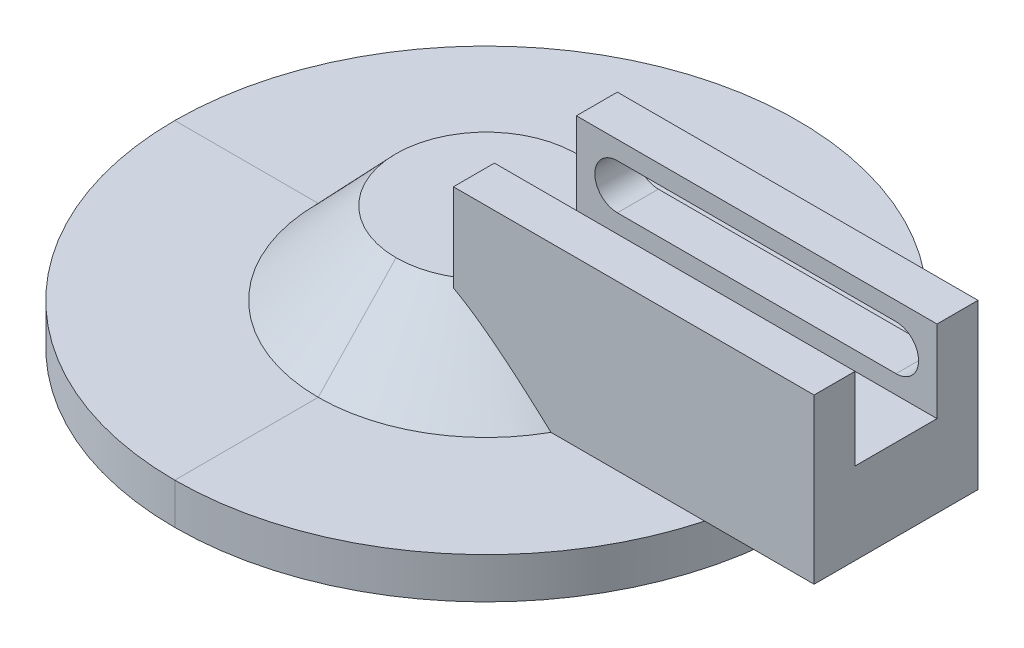
ISO-10303-21;
HEADER;
FILE_DESCRIPTION(('STEP AP214'),'2;1');
FILE_NAME('part.step','',(''),(''),'','','');
FILE_SCHEMA(('AUTOMOTIVE_DESIGN { 1 0 10303 214 1 1 1 1 }'));
ENDSEC;
DATA;
#1=APPLICATION_CONTEXT('core data for automotive mechanical design processes');
#2=APPLICATION_PROTOCOL_DEFINITION('international standard','automotive_design',2000,#1);
#3=PRODUCT_CONTEXT('',#1,'mechanical');
#4=PRODUCT('Part','Part','',(#3));
#5=PRODUCT_RELATED_PRODUCT_CATEGORY('part','',(#4));
#6=PRODUCT_DEFINITION_FORMATION('','',#4);
#7=PRODUCT_DEFINITION_CONTEXT('part definition',#1,'design');
#8=PRODUCT_DEFINITION('design','',#6,#7);
#9=PRODUCT_DEFINITION_SHAPE('','',#8);
#10=(LENGTH_UNIT() NAMED_UNIT(*) SI_UNIT(.MILLI.,.METRE.));
#11=(NAMED_UNIT(*) PLANE_ANGLE_UNIT() SI_UNIT($,.RADIAN.));
#12=(NAMED_UNIT(*) SI_UNIT($,.STERADIAN.) SOLID_ANGLE_UNIT());
#13=UNCERTAINTY_MEASURE_WITH_UNIT(LENGTH_MEASURE(1.E-05),#10,'distance_accuracy_value','');
#14=(GEOMETRIC_REPRESENTATION_CONTEXT(3) GLOBAL_UNCERTAINTY_ASSIGNED_CONTEXT((#13)) GLOBAL_UNIT_ASSIGNED_CONTEXT((#10,
#11,#12)) REPRESENTATION_CONTEXT('',''));
#15=CARTESIAN_POINT('',(0.,0.,0.));
#16=DIRECTION('',(0.,0.,1.));
#17=DIRECTION('',(1.,0.,0.));
#18=AXIS2_PLACEMENT_3D('',#15,#16,#17);
#19=CARTESIAN_POINT('',(0.,0.,0.));
#20=DIRECTION('',(0.,1.,0.));
#21=DIRECTION('',(0.,0.,1.));
#22=AXIS2_PLACEMENT_3D('',#19,#20,#21);
#23=PLANE('',#22);
#24=CARTESIAN_POINT('',(-6.,0.,-10.));
#25=DIRECTION('',(0.,-1.,0.));
#26=DIRECTION('',(-1.,0.,0.));
#27=AXIS2_PLACEMENT_3D('',#24,#25,#26);
#28=CIRCLE('',#27,11.);
#29=CARTESIAN_POINT('',(-17.,0.,-10.));
#30=VERTEX_POINT('',#29);
#31=CARTESIAN_POINT('',(-6.,0.,0.999999999999999));
#32=VERTEX_POINT('',#31);
#33=EDGE_CURVE('E54',#30,#32,#28,.T.);
#34=ORIENTED_EDGE('',*,*,#33,.T.);
#35=CARTESIAN_POINT('',(-6.,0.,-10.));
#36=DIRECTION('',(0.,-1.,0.));
#37=DIRECTION('',(0.,0.,1.));
#38=AXIS2_PLACEMENT_3D('',#35,#36,#37);
#39=CIRCLE('',#38,11.);
#40=EDGE_CURVE('E222',#32,#30,#39,.T.);
#41=ORIENTED_EDGE('',*,*,#40,.T.);
#42=EDGE_LOOP('',(#34,#41));
#43=FACE_BOUND('',#42,.T.);
#44=CARTESIAN_POINT('',(-6.,0.,-10.));
#45=DIRECTION('',(0.,1.,0.));
#46=DIRECTION('',(0.,0.,1.));
#47=AXIS2_PLACEMENT_3D('',#44,#45,#46);
#48=CIRCLE('',#47,2.55);
#49=CARTESIAN_POINT('',(-6.,0.,-7.45));
#50=VERTEX_POINT('',#49);
#51=EDGE_CURVE('E48',#50,#50,#48,.T.);
#52=ORIENTED_EDGE('',*,*,#51,.T.);
#53=EDGE_LOOP('',(#52));
#54=FACE_BOUND('',#53,.T.);
#55=ADVANCED_FACE('F43',(#43,#54),#23,.F.);
#56=CARTESIAN_POINT('',(-6.,7.5,-10.));
#57=DIRECTION('',(0.,-1.,0.));
#58=DIRECTION('',(0.,0.,-1.));
#59=AXIS2_PLACEMENT_3D('',#56,#57,#58);
#60=CYLINDRICAL_SURFACE('',#59,2.55);
#61=ORIENTED_EDGE('',*,*,#51,.F.);
#62=EDGE_LOOP('',(#61));
#63=FACE_BOUND('',#62,.T.);
#64=CARTESIAN_POINT('',(-6.,7.5,-10.));
#65=DIRECTION('',(0.,1.,0.));
#66=DIRECTION('',(0.,0.,1.));
#67=AXIS2_PLACEMENT_3D('',#64,#65,#66);
#68=CIRCLE('',#67,2.55);
#69=CARTESIAN_POINT('',(-6.,7.5,-7.45));
#70=VERTEX_POINT('',#69);
#71=EDGE_CURVE('E446',#70,#70,#68,.T.);
#72=ORIENTED_EDGE('',*,*,#71,.T.);
#73=EDGE_LOOP('',(#72));
#74=FACE_BOUND('',#73,.T.);
#75=ADVANCED_FACE('F513',(#63,#74),#60,.F.);
#76=CARTESIAN_POINT('',(0.,7.5,0.));
#77=DIRECTION('',(0.,1.,0.));
#78=DIRECTION('',(0.,0.,1.));
#79=AXIS2_PLACEMENT_3D('',#76,#77,#78);
#80=PLANE('',#79);
#81=ORIENTED_EDGE('',*,*,#71,.F.);
#82=EDGE_LOOP('',(#81));
#83=FACE_BOUND('',#82,.T.);
#84=ADVANCED_FACE('F519',(#83),#80,.F.);
#85=CARTESIAN_POINT('',(-26.5,0.,-10.));
#86=DIRECTION('',(0.,1.,0.));
#87=DIRECTION('',(0.,0.,1.));
#88=AXIS2_PLACEMENT_3D('',#85,#86,#87);
#89=PLANE('',#88);
#90=DIRECTION('',(1.,0.,0.));
#91=VECTOR('',#90,1.);
#92=CARTESIAN_POINT('',(0.,0.,0.));
#93=LINE('',#92,#91);
#94=CARTESIAN_POINT('',(11.8955301681733,0.,0.));
#95=VERTEX_POINT('',#94);
#96=CARTESIAN_POINT('',(30.6606055596467,0.,0.));
#97=VERTEX_POINT('',#96);
#98=EDGE_CURVE('E453',#95,#97,#93,.T.);
#99=ORIENTED_EDGE('',*,*,#98,.F.);
#100=CARTESIAN_POINT('',(-6.,0.,-10.));
#101=DIRECTION('',(0.,-1.,0.));
#102=DIRECTION('',(-1.,0.,0.));
#103=AXIS2_PLACEMENT_3D('',#100,#101,#102);
#104=CIRCLE('',#103,20.5);
#105=CARTESIAN_POINT('',(-5.99999999999999,0.,10.5));
#106=VERTEX_POINT('',#105);
#107=EDGE_CURVE('E270',#95,#106,#104,.T.);
#108=ORIENTED_EDGE('',*,*,#107,.T.);
#109=DIRECTION('',(0.,0.,-1.));
#110=VECTOR('',#109,1.);
#111=CARTESIAN_POINT('',(-6.,0.,10.5));
#112=LINE('',#111,#110);
#113=CARTESIAN_POINT('',(-5.99999999999999,0.,28.));
#114=VERTEX_POINT('',#113);
#115=EDGE_CURVE('E266',#114,#106,#112,.T.);
#116=ORIENTED_EDGE('',*,*,#115,.F.);
#117=CARTESIAN_POINT('',(-6.,0.,-10.));
#118=DIRECTION('',(0.,-1.,0.));
#119=DIRECTION('',(-1.,0.,0.));
#120=AXIS2_PLACEMENT_3D('',#117,#118,#119);
#121=CIRCLE('',#120,38.);
#122=EDGE_CURVE('E57',#97,#114,#121,.T.);
#123=ORIENTED_EDGE('',*,*,#122,.F.);
#124=EDGE_LOOP('',(#99,#108,#116,#123));
#125=FACE_BOUND('',#124,.T.);
#126=ADVANCED_FACE('F569',(#125),#89,.T.);
#127=CARTESIAN_POINT('',(-6.,0.,-10.));
#128=DIRECTION('',(0.,-1.,0.));
#129=DIRECTION('',(0.,0.,-1.));
#130=AXIS2_PLACEMENT_3D('',#127,#128,#129);
#131=CONICAL_SURFACE('',#130,20.5,0.759762754875771);
#132=CARTESIAN_POINT('',(0.,15.2631578517544,-10.0007));
#133=CARTESIAN_POINT('',(0.,15.2631708937644,-9.92486295488119));
#134=CARTESIAN_POINT('',(0.,15.2616624077463,-9.84903402731627));
#135=CARTESIAN_POINT('',(0.,15.2556377750741,-9.69750242471605));
#136=CARTESIAN_POINT('',(0.,15.2511219010244,-9.62179973886106));
#137=CARTESIAN_POINT('',(0.,15.2331331536125,-9.39524314324602));
#138=CARTESIAN_POINT('',(0.,15.2152189771487,-9.24472168165171));
#139=CARTESIAN_POINT('',(0.,15.168627023094,-8.94789489611168));
#140=CARTESIAN_POINT('',(0.,15.1401288071867,-8.80156080240538));
#141=CARTESIAN_POINT('',(0.,15.073321295965,-8.51112105104973));
#142=CARTESIAN_POINT('',(0.,15.035008501025,-8.36701620776956));
#143=CARTESIAN_POINT('',(0.,14.9148242663668,-7.96470673103297));
#144=CARTESIAN_POINT('',(0.,14.8229398833535,-7.70947797849739));
#145=CARTESIAN_POINT('',(0.,14.6171267733771,-7.20806455911059));
#146=CARTESIAN_POINT('',(0.,14.5031778808774,-6.96188841254049));
#147=CARTESIAN_POINT('',(0.,14.256573268325,-6.47349690640743));
#148=CARTESIAN_POINT('',(0.,14.1236121352738,-6.23143757873596));
#149=CARTESIAN_POINT('',(0.,13.8450417046871,-5.75491669936017));
#150=CARTESIAN_POINT('',(0.,13.6994370446049,-5.52045240487632));
#151=CARTESIAN_POINT('',(0.,13.3904074275809,-5.04505925818382));
#152=CARTESIAN_POINT('',(0.,13.2264428593904,-4.80448356497862));
#153=CARTESIAN_POINT('',(0.,12.8904741071394,-4.32898900687896));
#154=CARTESIAN_POINT('',(0.,12.71846857033,-4.09407110395168));
#155=CARTESIAN_POINT('',(0.,12.3681171760259,-3.62865646778906));
#156=CARTESIAN_POINT('',(0.,12.189765045737,-3.39816447597561));
#157=CARTESIAN_POINT('',(0.,11.8282218498624,-2.94100446813114));
#158=CARTESIAN_POINT('',(0.,11.6450305880864,-2.71433660775229));
#159=CARTESIAN_POINT('',(0.,11.2852803897885,-2.27691317133302));
#160=CARTESIAN_POINT('',(0.,11.1089330086854,-2.06598315994636));
#161=CARTESIAN_POINT('',(0.,10.7534323044949,-1.64649508178609));
#162=CARTESIAN_POINT('',(0.,10.5742789081329,-1.43793707720001));
#163=CARTESIAN_POINT('',(0.,10.2141334876021,-1.02338137324999));
#164=CARTESIAN_POINT('',(0.,10.0331475517093,-0.817378375762518));
#165=CARTESIAN_POINT('',(0.,9.66924727858725,-0.407110193079388));
#166=CARTESIAN_POINT('',(0.,9.48633309140965,-0.202844874864835));
#167=CARTESIAN_POINT('',(0.,9.30262732600062,0.000700000000000541));
#168=B_SPLINE_CURVE_WITH_KNOTS('',3,(#132,#133,#134,#135,#136,#137,#138,#139,#140,#141,#142,
#143,#144,#145,#146,#147,#148,#149,#150,#151,#152,#153,#154,#155,#156,#157,#158,#159,#160,#161,
#162,#163,#164,#165,#166,#167),.UNSPECIFIED.,.F.,.F.,(4,2,2,2,2,2,2,2,2,2,2,2,2,2,2,2,2,4),(0.,
0.227479877731248,0.454939138392,0.909202487800251,1.35608715263062,1.80313138734546,
2.6154365871104,3.42848771557544,4.25648699272817,5.08418384488504,5.95738068323528,
6.83072495369531,7.70495779307996,8.57922613059734,9.4040058705165,10.2288071842845,
11.0514352682714,11.8739998031617),.UNSPECIFIED.);
#169=CARTESIAN_POINT('',(0.,10.,-0.780455542707111));
#170=VERTEX_POINT('',#169);
#171=CARTESIAN_POINT('',(0.,9.30325916874674,0.));
#172=VERTEX_POINT('',#171);
#173=EDGE_CURVE('E345',#170,#172,#168,.T.);
#174=ORIENTED_EDGE('',*,*,#173,.F.);
#175=CARTESIAN_POINT('',(-6.,10.,-10.));
#176=DIRECTION('',(0.,-1.,0.));
#177=DIRECTION('',(-1.,0.,0.));
#178=AXIS2_PLACEMENT_3D('',#175,#176,#177);
#179=CIRCLE('',#178,11.);
#180=CARTESIAN_POINT('',(-6.,10.,0.999999999999999));
#181=VERTEX_POINT('',#180);
#182=EDGE_CURVE('E286',#170,#181,#179,.T.);
#183=ORIENTED_EDGE('',*,*,#182,.T.);
#184=DIRECTION('',(0.,0.724999433594414,-0.688749461914693));
#185=VECTOR('',#184,1.);
#186=CARTESIAN_POINT('',(-6.,10.,0.999999999999997));
#187=LINE('',#186,#185);
#188=EDGE_CURVE('E281',#106,#181,#187,.T.);
#189=ORIENTED_EDGE('',*,*,#188,.F.);
#190=ORIENTED_EDGE('',*,*,#107,.F.);
#191=CARTESIAN_POINT('',(-6.0007,11.0526315531579,0.));
#192=CARTESIAN_POINT('',(-5.87428990100135,11.0526470835422,0.));
#193=CARTESIAN_POINT('',(-5.74789347357525,11.0501261311713,0.));
#194=CARTESIAN_POINT('',(-5.49531136074231,11.0400703412784,0.));
#195=CARTESIAN_POINT('',(-5.36912565726386,11.0325359584597,0.));
#196=CARTESIAN_POINT('',(-4.99149011710038,11.0025295649885,0.));
#197=CARTESIAN_POINT('',(-4.74059485999688,10.9726539927723,0.));
#198=CARTESIAN_POINT('',(-4.24589052292776,10.8949699638763,0.));
#199=CARTESIAN_POINT('',(-4.00203279333361,10.8474649921303,0.));
#200=CARTESIAN_POINT('',(-3.51802910101837,10.7361081510763,0.));
#201=CARTESIAN_POINT('',(-3.27788451179349,10.6722503793089,0.));
#202=CARTESIAN_POINT('',(-2.60756353563897,10.47197350406,0.));
#203=CARTESIAN_POINT('',(-2.18234622399832,10.3188837780749,0.));
#204=CARTESIAN_POINT('',(-1.34694579797003,9.97598651775762,0.));
#205=CARTESIAN_POINT('',(-0.936776739894965,9.78614564381578,0.));
#206=CARTESIAN_POINT('',(-0.328195004622588,9.47885621297837,0.));
#207=CARTESIAN_POINT('',(-0.124556977982722,9.37154828823432,0.));
#208=CARTESIAN_POINT('',(0.279345023470627,9.15074460821882,0.));
#209=CARTESIAN_POINT('',(0.47960896149272,9.03724878553101,0.));
#210=CARTESIAN_POINT('',(0.876922827378911,8.80497812331635,0.));
#211=CARTESIAN_POINT('',(1.07397410682978,8.68620558640485,0.));
#212=CARTESIAN_POINT('',(1.46521431518069,8.44404563217753,0.));
#213=CARTESIAN_POINT('',(1.65940324397193,8.32065821468628,0.));
#214=CARTESIAN_POINT('',(2.0866640541892,8.04290211124555,0.));
#215=CARTESIAN_POINT('',(2.31911456288505,7.88757842314489,0.));
#216=CARTESIAN_POINT('',(2.78058453242819,7.57190672396082,0.));
#217=CARTESIAN_POINT('',(3.00960381302985,7.41155845028958,0.));
#218=CARTESIAN_POINT('',(3.69216827018812,6.92406138735136,0.));
#219=CARTESIAN_POINT('',(4.14114441417035,6.59051021275516,0.));
#220=CARTESIAN_POINT('',(5.03001741156925,5.91034873687691,0.));
#221=CARTESIAN_POINT('',(5.46990059293891,5.56372071155819,0.));
#222=CARTESIAN_POINT('',(6.34185728384099,4.86088917583055,0.));
#223=CARTESIAN_POINT('',(6.77393156099044,4.50468661525696,0.));
#224=CARTESIAN_POINT('',(7.60331909012637,3.80873302122002,0.));
#225=CARTESIAN_POINT('',(8.00103517604962,3.46946049826856,0.));
#226=CARTESIAN_POINT('',(8.79195830031774,2.78568004815452,0.));
#227=CARTESIAN_POINT('',(9.18516518477147,2.44117194323815,0.));
#228=CARTESIAN_POINT('',(9.96650356899167,1.74906852792403,0.));
#229=CARTESIAN_POINT('',(10.3546476389916,1.40148738279058,0.));
#230=CARTESIAN_POINT('',(11.1277263396571,0.702839657505729,0.));
#231=CARTESIAN_POINT('',(11.512661248033,0.351773384828647,0.));
#232=CARTESIAN_POINT('',(11.8962919467197,-0.000699999999995392,0.));
#233=B_SPLINE_CURVE_WITH_KNOTS('',3,(#191,#192,#193,#194,#195,#196,#197,#198,#199,#200,#201,
#202,#203,#204,#205,#206,#207,#208,#209,#210,#211,#212,#213,#214,#215,#216,#217,#218,#219,#220,
#221,#222,#223,#224,#225,#226,#227,#228,#229,#230,#231,#232),.UNSPECIFIED.,.F.,.F.,(4,2,2,2,2,2,
2,2,2,2,2,2,2,2,2,2,2,2,2,2,4),(0.,0.379178155385036,0.758321925126976,1.51551162529428,
2.2602293603117,3.00521627719552,4.35856721051394,5.71315166820957,6.40360764422959,
7.09407114418192,7.78423624845764,8.47440137896786,9.31302660095649,10.1516957233361,
11.8293055740761,13.5092772281205,15.1890828323667,16.7573270752707,18.3256246812712,
19.8886810294079,21.4516006816987),.UNSPECIFIED.);
#234=EDGE_CURVE('E338',#172,#95,#233,.T.);
#235=ORIENTED_EDGE('',*,*,#234,.F.);
#236=EDGE_LOOP('',(#174,#183,#189,#190,#235));
#237=FACE_BOUND('',#236,.T.);
#238=ADVANCED_FACE('F329',(#237),#131,.T.);
#239=CARTESIAN_POINT('',(-6.,0.,-10.));
#240=DIRECTION('',(0.,-1.,0.));
#241=DIRECTION('',(0.,0.,-1.));
#242=AXIS2_PLACEMENT_3D('',#239,#240,#241);
#243=CONICAL_SURFACE('',#242,20.5,0.759762754875771);
#244=CARTESIAN_POINT('',(-6.,0.,-10.));
#245=DIRECTION('',(0.,-1.,0.));
#246=DIRECTION('',(0.,0.,1.));
#247=AXIS2_PLACEMENT_3D('',#244,#245,#246);
#248=CIRCLE('',#247,20.5);
#249=CARTESIAN_POINT('',(-26.5,0.,-10.));
#250=VERTEX_POINT('',#249);
#251=EDGE_CURVE('E273',#106,#250,#248,.T.);
#252=ORIENTED_EDGE('',*,*,#251,.F.);
#253=ORIENTED_EDGE('',*,*,#188,.T.);
#254=CARTESIAN_POINT('',(-6.,10.,-10.));
#255=DIRECTION('',(0.,-1.,0.));
#256=DIRECTION('',(0.,0.,1.));
#257=AXIS2_PLACEMENT_3D('',#254,#255,#256);
#258=CIRCLE('',#257,11.);
#259=CARTESIAN_POINT('',(-17.,10.,-10.));
#260=VERTEX_POINT('',#259);
#261=EDGE_CURVE('E289',#181,#260,#258,.T.);
#262=ORIENTED_EDGE('',*,*,#261,.T.);
#263=DIRECTION('',(0.688749461914693,0.724999433594414,0.));
#264=VECTOR('',#263,1.);
#265=CARTESIAN_POINT('',(-17.,10.,-10.));
#266=LINE('',#265,#264);
#267=EDGE_CURVE('E277',#250,#260,#266,.T.);
#268=ORIENTED_EDGE('',*,*,#267,.F.);
#269=EDGE_LOOP('',(#252,#253,#262,#268));
#270=FACE_BOUND('',#269,.T.);
#271=ADVANCED_FACE('F332',(#270),#243,.T.);
#272=CARTESIAN_POINT('',(-6.,0.,10.5));
#273=DIRECTION('',(0.,1.,0.));
#274=DIRECTION('',(0.,0.,1.));
#275=AXIS2_PLACEMENT_3D('',#272,#273,#274);
#276=PLANE('',#275);
#277=CARTESIAN_POINT('',(-6.,0.,-10.));
#278=DIRECTION('',(0.,-1.,0.));
#279=DIRECTION('',(0.,0.,1.));
#280=AXIS2_PLACEMENT_3D('',#277,#278,#279);
#281=CIRCLE('',#280,38.);
#282=CARTESIAN_POINT('',(-44.,0.,-10.));
#283=VERTEX_POINT('',#282);
#284=EDGE_CURVE('E259',#114,#283,#281,.T.);
#285=ORIENTED_EDGE('',*,*,#284,.F.);
#286=ORIENTED_EDGE('',*,*,#115,.T.);
#287=ORIENTED_EDGE('',*,*,#251,.T.);
#288=DIRECTION('',(1.,0.,0.));
#289=VECTOR('',#288,1.);
#290=CARTESIAN_POINT('',(-26.5,0.,-10.));
#291=LINE('',#290,#289);
#292=EDGE_CURVE('E263',#283,#250,#291,.T.);
#293=ORIENTED_EDGE('',*,*,#292,.F.);
#294=EDGE_LOOP('',(#285,#286,#287,#293));
#295=FACE_BOUND('',#294,.T.);
#296=ADVANCED_FACE('F330',(#295),#276,.T.);
#297=CARTESIAN_POINT('',(-6.,0.,-10.));
#298=DIRECTION('',(0.,-1.,0.));
#299=DIRECTION('',(0.,0.,-1.));
#300=AXIS2_PLACEMENT_3D('',#297,#298,#299);
#301=CYLINDRICAL_SURFACE('',#300,38.);
#302=CARTESIAN_POINT('',(-6.,-5.,-10.));
#303=DIRECTION('',(0.,-1.,0.));
#304=DIRECTION('',(0.,0.,1.));
#305=AXIS2_PLACEMENT_3D('',#302,#303,#304);
#306=CIRCLE('',#305,38.);
#307=CARTESIAN_POINT('',(-5.99999999999999,-5.,28.));
#308=VERTEX_POINT('',#307);
#309=CARTESIAN_POINT('',(-44.,-5.,-10.));
#310=VERTEX_POINT('',#309);
#311=EDGE_CURVE('E249',#308,#310,#306,.T.);
#312=ORIENTED_EDGE('',*,*,#311,.F.);
#313=DIRECTION('',(0.,1.,0.));
#314=VECTOR('',#313,1.);
#315=CARTESIAN_POINT('',(-6.,0.,28.));
#316=LINE('',#315,#314);
#317=EDGE_CURVE('E254',#308,#114,#316,.T.);
#318=ORIENTED_EDGE('',*,*,#317,.T.);
#319=ORIENTED_EDGE('',*,*,#284,.T.);
#320=DIRECTION('',(0.,1.,0.));
#321=VECTOR('',#320,1.);
#322=CARTESIAN_POINT('',(-44.,0.,-10.));
#323=LINE('',#322,#321);
#324=EDGE_CURVE('E237',#310,#283,#323,.T.);
#325=ORIENTED_EDGE('',*,*,#324,.F.);
#326=EDGE_LOOP('',(#312,#318,#319,#325));
#327=FACE_BOUND('',#326,.T.);
#328=ADVANCED_FACE('F571',(#327),#301,.T.);
#329=CARTESIAN_POINT('',(-5.99999999999999,-5.,28.));
#330=DIRECTION('',(0.,-1.,0.));
#331=DIRECTION('',(0.,0.,-1.));
#332=AXIS2_PLACEMENT_3D('',#329,#330,#331);
#333=PLANE('',#332);
#334=CARTESIAN_POINT('',(-6.,-5.,-10.));
#335=DIRECTION('',(0.,-1.,0.));
#336=DIRECTION('',(0.,0.,1.));
#337=AXIS2_PLACEMENT_3D('',#334,#335,#336);
#338=CIRCLE('',#337,20.5);
#339=CARTESIAN_POINT('',(-5.99999999999999,-5.,10.5));
#340=VERTEX_POINT('',#339);
#341=CARTESIAN_POINT('',(-26.5,-5.,-10.));
#342=VERTEX_POINT('',#341);
#343=EDGE_CURVE('E226',#340,#342,#338,.T.);
#344=ORIENTED_EDGE('',*,*,#343,.F.);
#345=DIRECTION('',(0.,0.,1.));
#346=VECTOR('',#345,1.);
#347=CARTESIAN_POINT('',(-5.99999999999999,-5.,28.));
#348=LINE('',#347,#346);
#349=EDGE_CURVE('E242',#340,#308,#348,.T.);
#350=ORIENTED_EDGE('',*,*,#349,.T.);
#351=ORIENTED_EDGE('',*,*,#311,.T.);
#352=DIRECTION('',(-1.,0.,0.));
#353=VECTOR('',#352,1.);
#354=CARTESIAN_POINT('',(-44.,-5.,-10.));
#355=LINE('',#354,#353);
#356=EDGE_CURVE('E233',#342,#310,#355,.T.);
#357=ORIENTED_EDGE('',*,*,#356,.F.);
#358=EDGE_LOOP('',(#344,#350,#351,#357));
#359=FACE_BOUND('',#358,.T.);
#360=ADVANCED_FACE('F574',(#359),#333,.T.);
#361=CARTESIAN_POINT('',(-6.,0.,-10.));
#362=DIRECTION('',(0.,-1.,0.));
#363=DIRECTION('',(0.,0.,-1.));
#364=AXIS2_PLACEMENT_3D('',#361,#362,#363);
#365=CONICAL_SURFACE('',#364,11.,1.08631839775787);
#366=ORIENTED_EDGE('',*,*,#40,.F.);
#367=DIRECTION('',(0.,-0.465746432832622,0.884918222381982));
#368=VECTOR('',#367,1.);
#369=CARTESIAN_POINT('',(-6.,-5.,10.5));
#370=LINE('',#369,#368);
#371=EDGE_CURVE('E210',#32,#340,#370,.T.);
#372=ORIENTED_EDGE('',*,*,#371,.T.);
#373=ORIENTED_EDGE('',*,*,#343,.T.);
#374=DIRECTION('',(-0.884918222381982,-0.465746432832622,0.));
#375=VECTOR('',#374,1.);
#376=CARTESIAN_POINT('',(-26.5,-5.,-10.));
#377=LINE('',#376,#375);
#378=EDGE_CURVE('E208',#30,#342,#377,.T.);
#379=ORIENTED_EDGE('',*,*,#378,.F.);
#380=EDGE_LOOP('',(#366,#372,#373,#379));
#381=FACE_BOUND('',#380,.T.);
#382=ADVANCED_FACE('F229',(#381),#365,.F.);
#383=CARTESIAN_POINT('',(0.,9.30262732600062,-20.0007));
#384=CARTESIAN_POINT('',(0.,9.45897758168921,-19.8274733474114));
#385=CARTESIAN_POINT('',(0.,9.61474871746107,-19.6537210007934));
#386=CARTESIAN_POINT('',(0.,9.92492714396159,-19.3049916988483));
#387=CARTESIAN_POINT('',(0.,10.0793343820422,-19.1300146967113));
#388=CARTESIAN_POINT('',(0.,10.3867167655214,-18.7785052959458));
#389=CARTESIAN_POINT('',(0.,10.5396903719936,-18.6019715500502));
#390=CARTESIAN_POINT('',(0.,10.84377877381,-18.2473121991976));
#391=CARTESIAN_POINT('',(0.,10.9948935901542,-18.0691866122641));
#392=CARTESIAN_POINT('',(0.,11.297259734695,-17.7083194976375));
#393=CARTESIAN_POINT('',(0.,11.4484768115595,-17.5255492298987));
#394=CARTESIAN_POINT('',(0.,11.7482096392183,-17.1578079205162));
#395=CARTESIAN_POINT('',(0.,11.8967254300271,-16.9728369115396));
#396=CARTESIAN_POINT('',(0.,12.1904480226704,-16.6003867398087));
#397=CARTESIAN_POINT('',(0.,12.3356559835247,-16.4129084932694));
#398=CARTESIAN_POINT('',(0.,12.6220903766853,-16.034941696312));
#399=CARTESIAN_POINT('',(0.,12.7633169837997,-15.8444532786355));
#400=CARTESIAN_POINT('',(0.,13.0677088805686,-15.4227401129623));
#401=CARTESIAN_POINT('',(0.,13.2298354039591,-15.1907612279891));
#402=CARTESIAN_POINT('',(0.,13.5450055449841,-14.7205967725288));
#403=CARTESIAN_POINT('',(0.,13.6980472078464,-14.4824098820287));
#404=CARTESIAN_POINT('',(0.,13.9916892475622,-13.9990810486837));
#405=CARTESIAN_POINT('',(0.,14.1323139764668,-13.7539540232876));
#406=CARTESIAN_POINT('',(0.,14.3972045124265,-13.254999251772));
#407=CARTESIAN_POINT('',(0.,14.5214779610526,-13.0011756403017));
#408=CARTESIAN_POINT('',(0.,14.7122602926455,-12.5651661011735));
#409=CARTESIAN_POINT('',(0.,14.7846428950908,-12.3855615656707));
#410=CARTESIAN_POINT('',(0.,14.9167023128333,-12.0216540533984));
#411=CARTESIAN_POINT('',(0.,14.9763777380655,-11.8373505650674));
#412=CARTESIAN_POINT('',(0.,15.080283563693,-11.4652533095052));
#413=CARTESIAN_POINT('',(0.,15.1245799130169,-11.2774781757188));
#414=CARTESIAN_POINT('',(0.,15.1957048317262,-10.8987152928912));
#415=CARTESIAN_POINT('',(0.,15.2225480659465,-10.707730379638));
#416=CARTESIAN_POINT('',(0.,15.2475932694422,-10.4301152610768));
#417=CARTESIAN_POINT('',(0.,15.2534254834513,-10.3441272816656));
#418=CARTESIAN_POINT('',(0.,15.2612181820448,-10.1718643983291));
#419=CARTESIAN_POINT('',(0.,15.2631736231013,-10.0855892667148));
#420=CARTESIAN_POINT('',(0.,15.2631578517544,-9.9993));
#421=B_SPLINE_CURVE_WITH_KNOTS('',3,(#383,#384,#385,#386,#387,#388,#389,#390,#391,#392,#393,
#394,#395,#396,#397,#398,#399,#400,#401,#402,#403,#404,#405,#406,#407,#408,#409,#410,#411,#412,
#413,#414,#415,#416,#417,#418,#419,#420),.UNSPECIFIED.,.F.,.F.,(4,2,2,2,2,2,2,2,2,2,2,2,2,2,2,2,
2,2,4),(0.,0.700056192164329,1.40013929023301,2.10090329372611,2.80165937289681,
3.51328670922617,4.2249034955224,4.93626698132446,5.64759918470881,6.49648844596003,
7.34555970394545,8.1929269585169,9.03989678903591,9.62043989489112,10.2010464750021,
10.7791316066647,11.3567303772253,11.6152119797281,11.8740296364636),.UNSPECIFIED.);
#422=CARTESIAN_POINT('',(0.,9.30325916874674,-20.));
#423=VERTEX_POINT('',#422);
#424=CARTESIAN_POINT('',(0.,10.,-19.2195444572929));
#425=VERTEX_POINT('',#424);
#426=EDGE_CURVE('E299',#423,#425,#421,.T.);
#427=ORIENTED_EDGE('',*,*,#426,.F.);
#428=CARTESIAN_POINT('',(-6.0007,11.0526315531579,-20.));
#429=CARTESIAN_POINT('',(-5.87428990100135,11.0526470835422,-20.));
#430=CARTESIAN_POINT('',(-5.74789347357525,11.0501261311713,-20.));
#431=CARTESIAN_POINT('',(-5.49531136074232,11.0400703412784,-20.));
#432=CARTESIAN_POINT('',(-5.36912565726387,11.0325359584597,-20.));
#433=CARTESIAN_POINT('',(-4.99149011710038,11.0025295649885,-20.));
#434=CARTESIAN_POINT('',(-4.74059485999689,10.9726539927723,-20.));
#435=CARTESIAN_POINT('',(-4.24589052292776,10.8949699638763,-20.));
#436=CARTESIAN_POINT('',(-4.00203279333361,10.8474649921303,-20.));
#437=CARTESIAN_POINT('',(-3.51802910101837,10.7361081510763,-20.));
#438=CARTESIAN_POINT('',(-3.27788451179349,10.6722503793089,-20.));
#439=CARTESIAN_POINT('',(-2.60756353563897,10.47197350406,-20.));
#440=CARTESIAN_POINT('',(-2.18234622399832,10.3188837780749,-20.));
#441=CARTESIAN_POINT('',(-1.34694579797003,9.97598651775762,-20.));
#442=CARTESIAN_POINT('',(-0.936776739894967,9.78614564381578,-20.));
#443=CARTESIAN_POINT('',(-0.328195004622589,9.47885621297837,-20.));
#444=CARTESIAN_POINT('',(-0.124556977982722,9.37154828823432,-20.));
#445=CARTESIAN_POINT('',(0.279345023470626,9.15074460821882,-20.));
#446=CARTESIAN_POINT('',(0.479608961492719,9.03724878553101,-20.));
#447=CARTESIAN_POINT('',(0.876922827378911,8.80497812331635,-20.));
#448=CARTESIAN_POINT('',(1.07397410682978,8.68620558640486,-20.));
#449=CARTESIAN_POINT('',(1.46521431518069,8.44404563217753,-20.));
#450=CARTESIAN_POINT('',(1.65940324397193,8.32065821468628,-20.));
#451=CARTESIAN_POINT('',(2.0866640541892,8.04290211124555,-20.));
#452=CARTESIAN_POINT('',(2.31911456288505,7.88757842314489,-20.));
#453=CARTESIAN_POINT('',(2.78058453242819,7.57190672396082,-20.));
#454=CARTESIAN_POINT('',(3.00960381302985,7.41155845028957,-20.));
#455=CARTESIAN_POINT('',(3.69216827018812,6.92406138735136,-20.));
#456=CARTESIAN_POINT('',(4.14114441417035,6.59051021275515,-20.));
#457=CARTESIAN_POINT('',(5.03001741156925,5.91034873687691,-20.));
#458=CARTESIAN_POINT('',(5.46990059293891,5.56372071155818,-20.));
#459=CARTESIAN_POINT('',(6.34185728384099,4.86088917583055,-20.));
#460=CARTESIAN_POINT('',(6.77393156099044,4.50468661525696,-20.));
#461=CARTESIAN_POINT('',(7.60331909012638,3.80873302122002,-20.));
#462=CARTESIAN_POINT('',(8.00103517604962,3.46946049826856,-20.));
#463=CARTESIAN_POINT('',(8.79195830031775,2.78568004815451,-20.));
#464=CARTESIAN_POINT('',(9.18516518477148,2.44117194323815,-20.));
#465=CARTESIAN_POINT('',(9.96650356899167,1.74906852792403,-20.));
#466=CARTESIAN_POINT('',(10.3546476389916,1.40148738279058,-20.));
#467=CARTESIAN_POINT('',(11.1277263396571,0.702839657505725,-20.));
#468=CARTESIAN_POINT('',(11.512661248033,0.351773384828643,-20.));
#469=CARTESIAN_POINT('',(11.8962919467197,-0.000699999999998274,-20.));
#470=B_SPLINE_CURVE_WITH_KNOTS('',3,(#428,#429,#430,#431,#432,#433,#434,#435,#436,#437,#438,
#439,#440,#441,#442,#443,#444,#445,#446,#447,#448,#449,#450,#451,#452,#453,#454,#455,#456,#457,
#458,#459,#460,#461,#462,#463,#464,#465,#466,#467,#468,#469),.UNSPECIFIED.,.F.,.F.,(4,2,2,2,2,2,
2,2,2,2,2,2,2,2,2,2,2,2,2,2,4),(0.,0.379178155385036,0.758321925126975,1.51551162529428,
2.2602293603117,3.00521627719552,4.35856721051394,5.71315166820957,6.40360764422959,
7.09407114418192,7.78423624845764,8.47440137896786,9.31302660095649,10.1516957233361,
11.8293055740761,13.5092772281205,15.1890828323667,16.7573270752707,18.3256246812712,
19.8886810294079,21.4516006816987),.UNSPECIFIED.);
#471=CARTESIAN_POINT('',(11.8955301681733,0.,-20.));
#472=VERTEX_POINT('',#471);
#473=EDGE_CURVE('E313',#423,#472,#470,.T.);
#474=ORIENTED_EDGE('',*,*,#473,.T.);
#475=EDGE_CURVE('E282',#250,#472,#104,.T.);
#476=ORIENTED_EDGE('',*,*,#475,.F.);
#477=ORIENTED_EDGE('',*,*,#267,.T.);
#478=EDGE_CURVE('E64',#260,#425,#179,.T.);
#479=ORIENTED_EDGE('',*,*,#478,.T.);
#480=EDGE_LOOP('',(#427,#474,#476,#477,#479));
#481=FACE_BOUND('',#480,.T.);
#482=ADVANCED_FACE('F323',(#481),#131,.T.);
#483=ORIENTED_EDGE('',*,*,#475,.T.);
#484=DIRECTION('',(1.,0.,0.));
#485=VECTOR('',#484,1.);
#486=CARTESIAN_POINT('',(0.,0.,-20.));
#487=LINE('',#486,#485);
#488=CARTESIAN_POINT('',(30.6606055596467,0.,-20.));
#489=VERTEX_POINT('',#488);
#490=EDGE_CURVE('E461',#472,#489,#487,.T.);
#491=ORIENTED_EDGE('',*,*,#490,.T.);
#492=EDGE_CURVE('E56',#283,#489,#121,.T.);
#493=ORIENTED_EDGE('',*,*,#492,.F.);
#494=ORIENTED_EDGE('',*,*,#292,.T.);
#495=EDGE_LOOP('',(#483,#491,#493,#494));
#496=FACE_BOUND('',#495,.T.);
#497=ADVANCED_FACE('F328',(#496),#89,.T.);
#498=CARTESIAN_POINT('',(-6.,0.,-10.));
#499=DIRECTION('',(0.,-1.,0.));
#500=DIRECTION('',(0.,0.,-1.));
#501=AXIS2_PLACEMENT_3D('',#498,#499,#500);
#502=CYLINDRICAL_SURFACE('',#501,38.);
#503=ORIENTED_EDGE('',*,*,#492,.T.);
#504=EDGE_CURVE('E11',#489,#97,#121,.T.);
#505=ORIENTED_EDGE('',*,*,#504,.T.);
#506=ORIENTED_EDGE('',*,*,#122,.T.);
#507=ORIENTED_EDGE('',*,*,#317,.F.);
#508=CARTESIAN_POINT('',(-6.,-5.,-10.));
#509=DIRECTION('',(0.,-1.,0.));
#510=DIRECTION('',(-1.,0.,0.));
#511=AXIS2_PLACEMENT_3D('',#508,#509,#510);
#512=CIRCLE('',#511,38.);
#513=EDGE_CURVE('E246',#310,#308,#512,.T.);
#514=ORIENTED_EDGE('',*,*,#513,.F.);
#515=ORIENTED_EDGE('',*,*,#324,.T.);
#516=EDGE_LOOP('',(#503,#505,#506,#507,#514,#515));
#517=FACE_BOUND('',#516,.T.);
#518=ADVANCED_FACE('F562',(#517),#502,.T.);
#519=CARTESIAN_POINT('',(-44.,-5.,-10.));
#520=DIRECTION('',(0.,-1.,0.));
#521=DIRECTION('',(0.,0.,-1.));
#522=AXIS2_PLACEMENT_3D('',#519,#520,#521);
#523=PLANE('',#522);
#524=ORIENTED_EDGE('',*,*,#513,.T.);
#525=ORIENTED_EDGE('',*,*,#349,.F.);
#526=CARTESIAN_POINT('',(-6.,-5.,-10.));
#527=DIRECTION('',(0.,-1.,0.));
#528=DIRECTION('',(-1.,0.,0.));
#529=AXIS2_PLACEMENT_3D('',#526,#527,#528);
#530=CIRCLE('',#529,20.5);
#531=EDGE_CURVE('E243',#342,#340,#530,.T.);
#532=ORIENTED_EDGE('',*,*,#531,.F.);
#533=ORIENTED_EDGE('',*,*,#356,.T.);
#534=EDGE_LOOP('',(#524,#525,#532,#533));
#535=FACE_BOUND('',#534,.T.);
#536=ADVANCED_FACE('F577',(#535),#523,.T.);
#537=CARTESIAN_POINT('',(-6.,0.,-10.));
#538=DIRECTION('',(0.,-1.,0.));
#539=DIRECTION('',(0.,0.,-1.));
#540=AXIS2_PLACEMENT_3D('',#537,#538,#539);
#541=CONICAL_SURFACE('',#540,11.,1.08631839775787);
#542=ORIENTED_EDGE('',*,*,#531,.T.);
#543=ORIENTED_EDGE('',*,*,#371,.F.);
#544=ORIENTED_EDGE('',*,*,#33,.F.);
#545=ORIENTED_EDGE('',*,*,#378,.T.);
#546=EDGE_LOOP('',(#542,#543,#544,#545));
#547=FACE_BOUND('',#546,.T.);
#548=ADVANCED_FACE('F206',(#547),#541,.F.);
#549=CARTESIAN_POINT('',(0.,20.,0.));
#550=DIRECTION('',(0.,1.,0.));
#551=DIRECTION('',(0.,0.,1.));
#552=AXIS2_PLACEMENT_3D('',#549,#550,#551);
#553=PLANE('',#552);
#554=DIRECTION('',(0.,0.,1.));
#555=VECTOR('',#554,1.);
#556=CARTESIAN_POINT('',(0.,20.,-5.));
#557=LINE('',#556,#555);
#558=CARTESIAN_POINT('',(0.,20.,-5.));
#559=VERTEX_POINT('',#558);
#560=CARTESIAN_POINT('',(0.,20.,0.));
#561=VERTEX_POINT('',#560);
#562=EDGE_CURVE('E418',#559,#561,#557,.T.);
#563=ORIENTED_EDGE('',*,*,#562,.T.);
#564=DIRECTION('',(1.,0.,0.));
#565=VECTOR('',#564,1.);
#566=CARTESIAN_POINT('',(0.,20.,0.));
#567=LINE('',#566,#565);
#568=CARTESIAN_POINT('',(44.,20.,0.));
#569=VERTEX_POINT('',#568);
#570=EDGE_CURVE('E422',#561,#569,#567,.T.);
#571=ORIENTED_EDGE('',*,*,#570,.T.);
#572=DIRECTION('',(0.,0.,-1.));
#573=VECTOR('',#572,1.);
#574=CARTESIAN_POINT('',(44.,20.,-5.));
#575=LINE('',#574,#573);
#576=CARTESIAN_POINT('',(44.,20.,-5.));
#577=VERTEX_POINT('',#576);
#578=EDGE_CURVE('E426',#569,#577,#575,.T.);
#579=ORIENTED_EDGE('',*,*,#578,.T.);
#580=DIRECTION('',(-1.,0.,0.));
#581=VECTOR('',#580,1.);
#582=CARTESIAN_POINT('',(0.,20.,-5.));
#583=LINE('',#582,#581);
#584=EDGE_CURVE('E429',#577,#559,#583,.T.);
#585=ORIENTED_EDGE('',*,*,#584,.T.);
#586=EDGE_LOOP('',(#563,#571,#579,#585));
#587=FACE_BOUND('',#586,.T.);
#588=ADVANCED_FACE('F544',(#587),#553,.T.);
#589=CARTESIAN_POINT('',(5.,15.,-15.));
#590=DIRECTION('',(0.,0.,-1.));
#591=DIRECTION('',(-1.,0.,0.));
#592=AXIS2_PLACEMENT_3D('',#589,#590,#591);
#593=CYLINDRICAL_SURFACE('',#592,2.75);
#594=CARTESIAN_POINT('',(5.,15.,-20.));
#595=DIRECTION('',(0.,0.,-1.));
#596=DIRECTION('',(-1.,0.,0.));
#597=AXIS2_PLACEMENT_3D('',#594,#595,#596);
#598=CIRCLE('',#597,2.75);
#599=CARTESIAN_POINT('',(5.,12.25,-20.));
#600=VERTEX_POINT('',#599);
#601=CARTESIAN_POINT('',(5.,17.75,-20.));
#602=VERTEX_POINT('',#601);
#603=EDGE_CURVE('E390',#600,#602,#598,.T.);
#604=ORIENTED_EDGE('',*,*,#603,.T.);
#605=DIRECTION('',(0.,0.,-1.));
#606=VECTOR('',#605,1.);
#607=CARTESIAN_POINT('',(5.00000000000001,17.75,-15.));
#608=LINE('',#607,#606);
#609=CARTESIAN_POINT('',(5.00000000000001,17.75,-15.));
#610=VERTEX_POINT('',#609);
#611=EDGE_CURVE('E378',#610,#602,#608,.T.);
#612=ORIENTED_EDGE('',*,*,#611,.F.);
#613=CARTESIAN_POINT('',(5.,15.,-15.));
#614=DIRECTION('',(0.,0.,-1.));
#615=DIRECTION('',(-1.,0.,0.));
#616=AXIS2_PLACEMENT_3D('',#613,#614,#615);
#617=CIRCLE('',#616,2.75);
#618=CARTESIAN_POINT('',(5.,12.25,-15.));
#619=VERTEX_POINT('',#618);
#620=EDGE_CURVE('E364',#619,#610,#617,.T.);
#621=ORIENTED_EDGE('',*,*,#620,.F.);
#622=DIRECTION('',(0.,0.,-1.));
#623=VECTOR('',#622,1.);
#624=CARTESIAN_POINT('',(5.,12.25,-15.));
#625=LINE('',#624,#623);
#626=EDGE_CURVE('E72',#619,#600,#625,.T.);
#627=ORIENTED_EDGE('',*,*,#626,.T.);
#628=EDGE_LOOP('',(#604,#612,#621,#627));
#629=FACE_BOUND('',#628,.T.);
#630=ADVANCED_FACE('F494',(#629),#593,.F.);
#631=CARTESIAN_POINT('',(0.,17.75,-15.));
#632=DIRECTION('',(0.,-1.,0.));
#633=DIRECTION('',(1.,0.,0.));
#634=AXIS2_PLACEMENT_3D('',#631,#632,#633);
#635=PLANE('',#634);
#636=DIRECTION('',(0.,0.,-1.));
#637=VECTOR('',#636,1.);
#638=CARTESIAN_POINT('',(39.,17.75,-15.));
#639=LINE('',#638,#637);
#640=CARTESIAN_POINT('',(39.,17.75,-15.));
#641=VERTEX_POINT('',#640);
#642=CARTESIAN_POINT('',(39.,17.75,-20.));
#643=VERTEX_POINT('',#642);
#644=EDGE_CURVE('E382',#641,#643,#639,.T.);
#645=ORIENTED_EDGE('',*,*,#644,.F.);
#646=DIRECTION('',(-1.,0.,0.));
#647=VECTOR('',#646,1.);
#648=CARTESIAN_POINT('',(0.,17.75,-15.));
#649=LINE('',#648,#647);
#650=EDGE_CURVE('E368',#641,#610,#649,.T.);
#651=ORIENTED_EDGE('',*,*,#650,.T.);
#652=ORIENTED_EDGE('',*,*,#611,.T.);
#653=DIRECTION('',(-1.,0.,0.));
#654=VECTOR('',#653,1.);
#655=CARTESIAN_POINT('',(0.,17.75,-20.));
#656=LINE('',#655,#654);
#657=EDGE_CURVE('E479',#643,#602,#656,.T.);
#658=ORIENTED_EDGE('',*,*,#657,.F.);
#659=EDGE_LOOP('',(#645,#651,#652,#658));
#660=FACE_BOUND('',#659,.T.);
#661=ADVANCED_FACE('F496',(#660),#635,.T.);
#662=CARTESIAN_POINT('',(39.,15.,-15.));
#663=DIRECTION('',(0.,0.,-1.));
#664=DIRECTION('',(-1.,0.,0.));
#665=AXIS2_PLACEMENT_3D('',#662,#663,#664);
#666=CYLINDRICAL_SURFACE('',#665,2.74999999999999);
#667=CARTESIAN_POINT('',(39.,15.,-20.));
#668=DIRECTION('',(0.,0.,-1.));
#669=DIRECTION('',(-1.,0.,0.));
#670=AXIS2_PLACEMENT_3D('',#667,#668,#669);
#671=CIRCLE('',#670,2.74999999999999);
#672=CARTESIAN_POINT('',(39.,12.25,-20.));
#673=VERTEX_POINT('',#672);
#674=EDGE_CURVE('E483',#643,#673,#671,.T.);
#675=ORIENTED_EDGE('',*,*,#674,.T.);
#676=DIRECTION('',(0.,0.,-1.));
#677=VECTOR('',#676,1.);
#678=CARTESIAN_POINT('',(39.,12.25,-15.));
#679=LINE('',#678,#677);
#680=CARTESIAN_POINT('',(39.,12.25,-15.));
#681=VERTEX_POINT('',#680);
#682=EDGE_CURVE('E386',#681,#673,#679,.T.);
#683=ORIENTED_EDGE('',*,*,#682,.F.);
#684=CARTESIAN_POINT('',(39.,15.,-15.));
#685=DIRECTION('',(0.,0.,-1.));
#686=DIRECTION('',(-1.,0.,0.));
#687=AXIS2_PLACEMENT_3D('',#684,#685,#686);
#688=CIRCLE('',#687,2.74999999999999);
#689=EDGE_CURVE('E372',#641,#681,#688,.T.);
#690=ORIENTED_EDGE('',*,*,#689,.F.);
#691=ORIENTED_EDGE('',*,*,#644,.T.);
#692=EDGE_LOOP('',(#675,#683,#690,#691));
#693=FACE_BOUND('',#692,.T.);
#694=ADVANCED_FACE('F503',(#693),#666,.F.);
#695=CARTESIAN_POINT('',(0.,12.25,-15.));
#696=DIRECTION('',(0.,-1.,0.));
#697=DIRECTION('',(0.,0.,-1.));
#698=AXIS2_PLACEMENT_3D('',#695,#696,#697);
#699=PLANE('',#698);
#700=DIRECTION('',(1.,0.,0.));
#701=VECTOR('',#700,1.);
#702=CARTESIAN_POINT('',(0.,12.25,-20.));
#703=LINE('',#702,#701);
#704=EDGE_CURVE('E396',#673,#600,#703,.F.);
#705=ORIENTED_EDGE('',*,*,#704,.T.);
#706=ORIENTED_EDGE('',*,*,#626,.F.);
#707=DIRECTION('',(-1.,0.,0.));
#708=VECTOR('',#707,1.);
#709=CARTESIAN_POINT('',(0.,12.25,-15.));
#710=LINE('',#709,#708);
#711=EDGE_CURVE('E360',#681,#619,#710,.T.);
#712=ORIENTED_EDGE('',*,*,#711,.F.);
#713=ORIENTED_EDGE('',*,*,#682,.T.);
#714=EDGE_LOOP('',(#705,#706,#712,#713));
#715=FACE_BOUND('',#714,.T.);
#716=ADVANCED_FACE('F489',(#715),#699,.F.);
#717=CARTESIAN_POINT('',(44.,7.5,0.));
#718=DIRECTION('',(1.,0.,0.));
#719=DIRECTION('',(0.,0.,-1.));
#720=AXIS2_PLACEMENT_3D('',#717,#718,#719);
#721=PLANE('',#720);
#722=DIRECTION('',(0.,0.,1.));
#723=VECTOR('',#722,1.);
#724=CARTESIAN_POINT('',(44.,0.,0.));
#725=LINE('',#724,#723);
#726=CARTESIAN_POINT('',(44.,0.,-20.));
#727=VERTEX_POINT('',#726);
#728=CARTESIAN_POINT('',(44.,0.,0.));
#729=VERTEX_POINT('',#728);
#730=EDGE_CURVE('E454',#727,#729,#725,.T.);
#731=ORIENTED_EDGE('',*,*,#730,.F.);
#732=DIRECTION('',(0.,-1.,0.));
#733=VECTOR('',#732,1.);
#734=CARTESIAN_POINT('',(44.,7.5,-20.));
#735=LINE('',#734,#733);
#736=CARTESIAN_POINT('',(44.,20.,-20.));
#737=VERTEX_POINT('',#736);
#738=EDGE_CURVE('E466',#737,#727,#735,.T.);
#739=ORIENTED_EDGE('',*,*,#738,.F.);
#740=DIRECTION('',(0.,0.,-1.));
#741=VECTOR('',#740,1.);
#742=CARTESIAN_POINT('',(44.,20.,-15.));
#743=LINE('',#742,#741);
#744=CARTESIAN_POINT('',(44.,20.,-15.));
#745=VERTEX_POINT('',#744);
#746=EDGE_CURVE('E405',#745,#737,#743,.T.);
#747=ORIENTED_EDGE('',*,*,#746,.F.);
#748=DIRECTION('',(0.,-1.,0.));
#749=VECTOR('',#748,1.);
#750=CARTESIAN_POINT('',(44.,20.,-15.));
#751=LINE('',#750,#749);
#752=CARTESIAN_POINT('',(44.,10.,-15.));
#753=VERTEX_POINT('',#752);
#754=EDGE_CURVE('E395',#745,#753,#751,.T.);
#755=ORIENTED_EDGE('',*,*,#754,.T.);
#756=DIRECTION('',(0.,0.,-1.));
#757=VECTOR('',#756,1.);
#758=CARTESIAN_POINT('',(44.,10.,0.));
#759=LINE('',#758,#757);
#760=CARTESIAN_POINT('',(44.,10.,-5.));
#761=VERTEX_POINT('',#760);
#762=EDGE_CURVE('E442',#761,#753,#759,.T.);
#763=ORIENTED_EDGE('',*,*,#762,.F.);
#764=DIRECTION('',(0.,-1.,0.));
#765=VECTOR('',#764,1.);
#766=CARTESIAN_POINT('',(44.,20.,-5.));
#767=LINE('',#766,#765);
#768=EDGE_CURVE('E438',#577,#761,#767,.T.);
#769=ORIENTED_EDGE('',*,*,#768,.F.);
#770=ORIENTED_EDGE('',*,*,#578,.F.);
#771=DIRECTION('',(0.,-1.,0.));
#772=VECTOR('',#771,1.);
#773=CARTESIAN_POINT('',(44.,7.5,0.));
#774=LINE('',#773,#772);
#775=EDGE_CURVE('E470',#569,#729,#774,.T.);
#776=ORIENTED_EDGE('',*,*,#775,.T.);
#777=EDGE_LOOP('',(#731,#739,#747,#755,#763,#769,#770,#776));
#778=FACE_BOUND('',#777,.T.);
#779=ADVANCED_FACE('F509',(#778),#721,.T.);
#780=CARTESIAN_POINT('',(0.,10.,0.));
#781=DIRECTION('',(0.,1.,0.));
#782=DIRECTION('',(0.,0.,1.));
#783=AXIS2_PLACEMENT_3D('',#780,#781,#782);
#784=PLANE('',#783);
#785=ORIENTED_EDGE('',*,*,#182,.F.);
#786=DIRECTION('',(0.,0.,1.));
#787=VECTOR('',#786,1.);
#788=CARTESIAN_POINT('',(0.,10.,0.));
#789=LINE('',#788,#787);
#790=CARTESIAN_POINT('',(0.,10.,-5.));
#791=VERTEX_POINT('',#790);
#792=EDGE_CURVE('E356',#791,#170,#789,.T.);
#793=ORIENTED_EDGE('',*,*,#792,.F.);
#794=DIRECTION('',(-1.,0.,0.));
#795=VECTOR('',#794,1.);
#796=CARTESIAN_POINT('',(0.,10.,-5.));
#797=LINE('',#796,#795);
#798=EDGE_CURVE('E404',#761,#791,#797,.T.);
#799=ORIENTED_EDGE('',*,*,#798,.F.);
#800=ORIENTED_EDGE('',*,*,#762,.T.);
#801=DIRECTION('',(1.,0.,0.));
#802=VECTOR('',#801,1.);
#803=CARTESIAN_POINT('',(44.,10.,-15.));
#804=LINE('',#803,#802);
#805=CARTESIAN_POINT('',(0.,10.,-15.));
#806=VERTEX_POINT('',#805);
#807=EDGE_CURVE('E401',#806,#753,#804,.T.);
#808=ORIENTED_EDGE('',*,*,#807,.F.);
#809=DIRECTION('',(0.,0.,1.));
#810=VECTOR('',#809,1.);
#811=CARTESIAN_POINT('',(0.,10.,0.));
#812=LINE('',#811,#810);
#813=EDGE_CURVE('E353',#425,#806,#812,.T.);
#814=ORIENTED_EDGE('',*,*,#813,.F.);
#815=ORIENTED_EDGE('',*,*,#478,.F.);
#816=ORIENTED_EDGE('',*,*,#261,.F.);
#817=EDGE_LOOP('',(#785,#793,#799,#800,#808,#814,#815,#816));
#818=FACE_BOUND('',#817,.T.);
#819=ADVANCED_FACE('F605',(#818),#784,.T.);
#820=CARTESIAN_POINT('',(0.,20.,-5.));
#821=DIRECTION('',(0.,0.,1.));
#822=DIRECTION('',(1.,0.,0.));
#823=AXIS2_PLACEMENT_3D('',#820,#821,#822);
#824=PLANE('',#823);
#825=ORIENTED_EDGE('',*,*,#798,.T.);
#826=DIRECTION('',(0.,-1.,0.));
#827=VECTOR('',#826,1.);
#828=CARTESIAN_POINT('',(0.,20.,-5.));
#829=LINE('',#828,#827);
#830=EDGE_CURVE('E432',#559,#791,#829,.T.);
#831=ORIENTED_EDGE('',*,*,#830,.F.);
#832=ORIENTED_EDGE('',*,*,#584,.F.);
#833=ORIENTED_EDGE('',*,*,#768,.T.);
#834=EDGE_LOOP('',(#825,#831,#832,#833));
#835=FACE_BOUND('',#834,.T.);
#836=ADVANCED_FACE('F608',(#835),#824,.F.);
#837=CARTESIAN_POINT('',(0.,20.,0.));
#838=DIRECTION('',(0.,1.,0.));
#839=DIRECTION('',(0.,0.,1.));
#840=AXIS2_PLACEMENT_3D('',#837,#838,#839);
#841=PLANE('',#840);
#842=ORIENTED_EDGE('',*,*,#746,.T.);
#843=DIRECTION('',(-1.,0.,0.));
#844=VECTOR('',#843,1.);
#845=CARTESIAN_POINT('',(44.,20.,-20.));
#846=LINE('',#845,#844);
#847=CARTESIAN_POINT('',(0.,20.,-20.));
#848=VERTEX_POINT('',#847);
#849=EDGE_CURVE('E411',#737,#848,#846,.T.);
#850=ORIENTED_EDGE('',*,*,#849,.T.);
#851=DIRECTION('',(0.,0.,1.));
#852=VECTOR('',#851,1.);
#853=CARTESIAN_POINT('',(0.,20.,-15.));
#854=LINE('',#853,#852);
#855=CARTESIAN_POINT('',(0.,20.,-15.));
#856=VERTEX_POINT('',#855);
#857=EDGE_CURVE('E408',#848,#856,#854,.T.);
#858=ORIENTED_EDGE('',*,*,#857,.T.);
#859=DIRECTION('',(1.,0.,0.));
#860=VECTOR('',#859,1.);
#861=CARTESIAN_POINT('',(44.,20.,-15.));
#862=LINE('',#861,#860);
#863=EDGE_CURVE('E400',#856,#745,#862,.T.);
#864=ORIENTED_EDGE('',*,*,#863,.T.);
#865=EDGE_LOOP('',(#842,#850,#858,#864));
#866=FACE_BOUND('',#865,.T.);
#867=ADVANCED_FACE('F612',(#866),#841,.T.);
#868=CARTESIAN_POINT('',(44.,20.,-15.));
#869=DIRECTION('',(0.,0.,-1.));
#870=DIRECTION('',(-1.,0.,0.));
#871=AXIS2_PLACEMENT_3D('',#868,#869,#870);
#872=PLANE('',#871);
#873=ORIENTED_EDGE('',*,*,#689,.T.);
#874=ORIENTED_EDGE('',*,*,#711,.T.);
#875=ORIENTED_EDGE('',*,*,#620,.T.);
#876=ORIENTED_EDGE('',*,*,#650,.F.);
#877=EDGE_LOOP('',(#873,#874,#875,#876));
#878=FACE_BOUND('',#877,.T.);
#879=ORIENTED_EDGE('',*,*,#807,.T.);
#880=ORIENTED_EDGE('',*,*,#754,.F.);
#881=ORIENTED_EDGE('',*,*,#863,.F.);
#882=DIRECTION('',(0.,-1.,0.));
#883=VECTOR('',#882,1.);
#884=CARTESIAN_POINT('',(0.,20.,-15.));
#885=LINE('',#884,#883);
#886=EDGE_CURVE('E391',#856,#806,#885,.T.);
#887=ORIENTED_EDGE('',*,*,#886,.T.);
#888=EDGE_LOOP('',(#879,#880,#881,#887));
#889=FACE_BOUND('',#888,.T.);
#890=ADVANCED_FACE('F500',(#878,#889),#872,.F.);
#891=CARTESIAN_POINT('',(0.,7.5,0.));
#892=DIRECTION('',(0.,0.,-1.));
#893=DIRECTION('',(-1.,0.,0.));
#894=AXIS2_PLACEMENT_3D('',#891,#892,#893);
#895=PLANE('',#894);
#896=DIRECTION('',(0.,-1.,0.));
#897=VECTOR('',#896,1.);
#898=CARTESIAN_POINT('',(0.,7.5,0.));
#899=LINE('',#898,#897);
#900=EDGE_CURVE('E214',#561,#172,#899,.T.);
#901=ORIENTED_EDGE('',*,*,#900,.T.);
#902=ORIENTED_EDGE('',*,*,#234,.T.);
#903=ORIENTED_EDGE('',*,*,#98,.T.);
#904=EDGE_CURVE('E450',#97,#729,#93,.T.);
#905=ORIENTED_EDGE('',*,*,#904,.T.);
#906=ORIENTED_EDGE('',*,*,#775,.F.);
#907=ORIENTED_EDGE('',*,*,#570,.F.);
#908=EDGE_LOOP('',(#901,#902,#903,#905,#906,#907));
#909=FACE_BOUND('',#908,.T.);
#910=ADVANCED_FACE('F45',(#909),#895,.F.);
#911=CARTESIAN_POINT('',(0.,7.5,0.));
#912=DIRECTION('',(1.,0.,0.));
#913=DIRECTION('',(0.,0.,-1.));
#914=AXIS2_PLACEMENT_3D('',#911,#912,#913);
#915=PLANE('',#914);
#916=ORIENTED_EDGE('',*,*,#830,.T.);
#917=ORIENTED_EDGE('',*,*,#792,.T.);
#918=ORIENTED_EDGE('',*,*,#173,.T.);
#919=ORIENTED_EDGE('',*,*,#900,.F.);
#920=ORIENTED_EDGE('',*,*,#562,.F.);
#921=EDGE_LOOP('',(#916,#917,#918,#919,#920));
#922=FACE_BOUND('',#921,.T.);
#923=ADVANCED_FACE('F549',(#922),#915,.F.);
#924=ORIENTED_EDGE('',*,*,#426,.T.);
#925=ORIENTED_EDGE('',*,*,#813,.T.);
#926=ORIENTED_EDGE('',*,*,#886,.F.);
#927=ORIENTED_EDGE('',*,*,#857,.F.);
#928=DIRECTION('',(0.,-1.,0.));
#929=VECTOR('',#928,1.);
#930=CARTESIAN_POINT('',(0.,7.5,-20.));
#931=LINE('',#930,#929);
#932=EDGE_CURVE('E462',#848,#423,#931,.T.);
#933=ORIENTED_EDGE('',*,*,#932,.T.);
#934=EDGE_LOOP('',(#924,#925,#926,#927,#933));
#935=FACE_BOUND('',#934,.T.);
#936=ADVANCED_FACE('F320',(#935),#915,.F.);
#937=CARTESIAN_POINT('',(0.,7.5,-20.));
#938=DIRECTION('',(0.,0.,-1.));
#939=DIRECTION('',(-1.,0.,0.));
#940=AXIS2_PLACEMENT_3D('',#937,#938,#939);
#941=PLANE('',#940);
#942=ORIENTED_EDGE('',*,*,#473,.F.);
#943=ORIENTED_EDGE('',*,*,#932,.F.);
#944=ORIENTED_EDGE('',*,*,#849,.F.);
#945=ORIENTED_EDGE('',*,*,#738,.T.);
#946=EDGE_CURVE('E458',#489,#727,#487,.T.);
#947=ORIENTED_EDGE('',*,*,#946,.F.);
#948=ORIENTED_EDGE('',*,*,#490,.F.);
#949=EDGE_LOOP('',(#942,#943,#944,#945,#947,#948));
#950=FACE_BOUND('',#949,.T.);
#951=ORIENTED_EDGE('',*,*,#704,.F.);
#952=ORIENTED_EDGE('',*,*,#674,.F.);
#953=ORIENTED_EDGE('',*,*,#657,.T.);
#954=ORIENTED_EDGE('',*,*,#603,.F.);
#955=EDGE_LOOP('',(#951,#952,#953,#954));
#956=FACE_BOUND('',#955,.T.);
#957=ADVANCED_FACE('F493',(#950,#956),#941,.T.);
#958=ORIENTED_EDGE('',*,*,#504,.F.);
#959=ORIENTED_EDGE('',*,*,#946,.T.);
#960=ORIENTED_EDGE('',*,*,#730,.T.);
#961=ORIENTED_EDGE('',*,*,#904,.F.);
#962=EDGE_LOOP('',(#958,#959,#960,#961));
#963=FACE_BOUND('',#962,.T.);
#964=ADVANCED_FACE('F515',(#963),#23,.F.);
#965=CLOSED_SHELL('',(#55,#75,#84,#126,#238,#271,#296,#328,#360,#382,#482,#497,#518,#536,#548,
#588,#630,#661,#694,#716,#779,#819,#836,#867,#890,#910,#923,#936,#957,#964));
#966=MANIFOLD_SOLID_BREP('B2',#965);
#967=ADVANCED_BREP_SHAPE_REPRESENTATION('',(#18,#966),#14);
#968=SHAPE_DEFINITION_REPRESENTATION(#9,#967);
ENDSEC;
END-ISO-10303-21;
